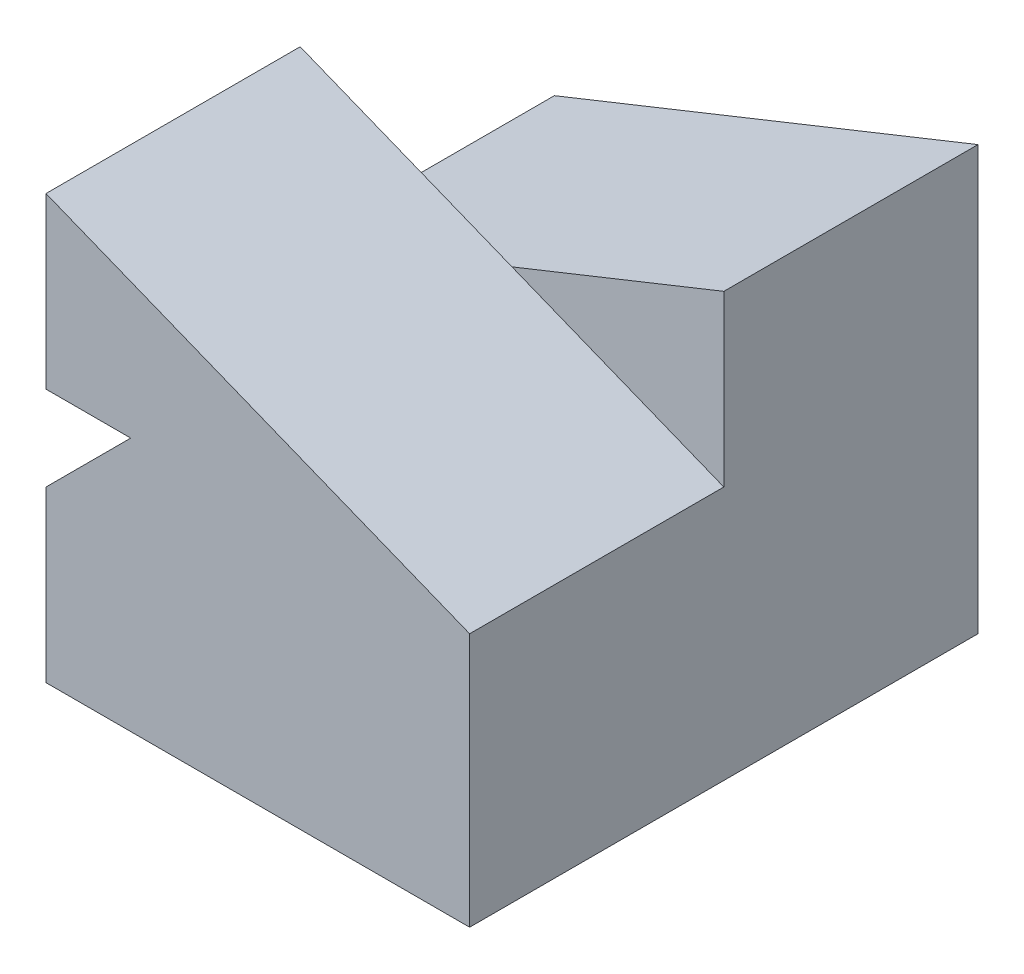
ISO-10303-21;
HEADER;
FILE_DESCRIPTION(('STEP AP214'),'2;1');
FILE_NAME('part.step','',(''),(''),'','','');
FILE_SCHEMA(('AUTOMOTIVE_DESIGN { 1 0 10303 214 1 1 1 1 }'));
ENDSEC;
DATA;
#1=APPLICATION_CONTEXT('core data for automotive mechanical design processes');
#2=APPLICATION_PROTOCOL_DEFINITION('international standard','automotive_design',2000,#1);
#3=PRODUCT_CONTEXT('',#1,'mechanical');
#4=PRODUCT('Part','Part','',(#3));
#5=PRODUCT_RELATED_PRODUCT_CATEGORY('part','',(#4));
#6=PRODUCT_DEFINITION_FORMATION('','',#4);
#7=PRODUCT_DEFINITION_CONTEXT('part definition',#1,'design');
#8=PRODUCT_DEFINITION('design','',#6,#7);
#9=PRODUCT_DEFINITION_SHAPE('','',#8);
#10=(LENGTH_UNIT() NAMED_UNIT(*) SI_UNIT(.MILLI.,.METRE.));
#11=(NAMED_UNIT(*) PLANE_ANGLE_UNIT() SI_UNIT($,.RADIAN.));
#12=(NAMED_UNIT(*) SI_UNIT($,.STERADIAN.) SOLID_ANGLE_UNIT());
#13=UNCERTAINTY_MEASURE_WITH_UNIT(LENGTH_MEASURE(1.E-05),#10,'distance_accuracy_value','');
#14=(GEOMETRIC_REPRESENTATION_CONTEXT(3) GLOBAL_UNCERTAINTY_ASSIGNED_CONTEXT((#13)) GLOBAL_UNIT_ASSIGNED_CONTEXT((#10,
#11,#12)) REPRESENTATION_CONTEXT('',''));
#15=CARTESIAN_POINT('',(0.,0.,0.));
#16=DIRECTION('',(0.,0.,1.));
#17=DIRECTION('',(1.,0.,0.));
#18=AXIS2_PLACEMENT_3D('',#15,#16,#17);
#19=CARTESIAN_POINT('',(0.,0.,0.));
#20=DIRECTION('',(0.,0.,1.));
#21=DIRECTION('',(1.,0.,0.));
#22=AXIS2_PLACEMENT_3D('',#19,#20,#21);
#23=PLANE('',#22);
#24=DIRECTION('',(0.928476690885259,0.371390676354104,0.));
#25=VECTOR('',#24,1.);
#26=CARTESIAN_POINT('',(0.,25.,0.));
#27=LINE('',#26,#25);
#28=CARTESIAN_POINT('',(-25.,15.,0.));
#29=VERTEX_POINT('',#28);
#30=CARTESIAN_POINT('',(-12.5,20.,0.));
#31=VERTEX_POINT('',#30);
#32=EDGE_CURVE('E143',#29,#31,#27,.T.);
#33=ORIENTED_EDGE('',*,*,#32,.F.);
#34=DIRECTION('',(0.,1.,0.));
#35=VECTOR('',#34,1.);
#36=CARTESIAN_POINT('',(-25.,25.,0.));
#37=LINE('',#36,#35);
#38=CARTESIAN_POINT('',(-25.,25.,0.));
#39=VERTEX_POINT('',#38);
#40=EDGE_CURVE('E156',#29,#39,#37,.T.);
#41=ORIENTED_EDGE('',*,*,#40,.T.);
#42=DIRECTION('',(0.928476690885259,-0.371390676354104,0.));
#43=VECTOR('',#42,1.);
#44=CARTESIAN_POINT('',(0.,15.,0.));
#45=LINE('',#44,#43);
#46=EDGE_CURVE('E192',#39,#31,#45,.T.);
#47=ORIENTED_EDGE('',*,*,#46,.T.);
#48=EDGE_LOOP('',(#33,#41,#47));
#49=FACE_BOUND('',#48,.T.);
#50=ADVANCED_FACE('F33',(#49),#23,.F.);
#51=CARTESIAN_POINT('',(-25.,10.,15.));
#52=DIRECTION('',(1.,0.,0.));
#53=DIRECTION('',(0.,0.,-1.));
#54=AXIS2_PLACEMENT_3D('',#51,#52,#53);
#55=PLANE('',#54);
#56=DIRECTION('',(0.,0.,-1.));
#57=VECTOR('',#56,1.);
#58=CARTESIAN_POINT('',(-25.,10.,15.));
#59=LINE('',#58,#57);
#60=CARTESIAN_POINT('',(-25.,10.,15.));
#61=VERTEX_POINT('',#60);
#62=CARTESIAN_POINT('',(-25.,10.,0.));
#63=VERTEX_POINT('',#62);
#64=EDGE_CURVE('E171',#61,#63,#59,.T.);
#65=ORIENTED_EDGE('',*,*,#64,.T.);
#66=DIRECTION('',(0.,1.,0.));
#67=VECTOR('',#66,1.);
#68=CARTESIAN_POINT('',(-25.,15.,0.));
#69=LINE('',#68,#67);
#70=EDGE_CURVE('E135',#63,#29,#69,.T.);
#71=ORIENTED_EDGE('',*,*,#70,.T.);
#72=DIRECTION('',(0.,0.,1.));
#73=VECTOR('',#72,1.);
#74=CARTESIAN_POINT('',(-25.,15.,-15.));
#75=LINE('',#74,#73);
#76=CARTESIAN_POINT('',(-25.,15.,-15.));
#77=VERTEX_POINT('',#76);
#78=EDGE_CURVE('E149',#77,#29,#75,.T.);
#79=ORIENTED_EDGE('',*,*,#78,.F.);
#80=DIRECTION('',(0.,1.,0.));
#81=VECTOR('',#80,1.);
#82=CARTESIAN_POINT('',(-25.,15.,-15.));
#83=LINE('',#82,#81);
#84=CARTESIAN_POINT('',(-25.,0.,-15.));
#85=VERTEX_POINT('',#84);
#86=EDGE_CURVE('E129',#85,#77,#83,.T.);
#87=ORIENTED_EDGE('',*,*,#86,.F.);
#88=DIRECTION('',(0.,0.,-1.));
#89=VECTOR('',#88,1.);
#90=CARTESIAN_POINT('',(-25.,0.,15.));
#91=LINE('',#90,#89);
#92=CARTESIAN_POINT('',(-25.,0.,15.));
#93=VERTEX_POINT('',#92);
#94=EDGE_CURVE('E11',#93,#85,#91,.T.);
#95=ORIENTED_EDGE('',*,*,#94,.F.);
#96=DIRECTION('',(0.,-1.,0.));
#97=VECTOR('',#96,1.);
#98=CARTESIAN_POINT('',(-25.,10.,15.));
#99=LINE('',#98,#97);
#100=EDGE_CURVE('E166',#61,#93,#99,.T.);
#101=ORIENTED_EDGE('',*,*,#100,.F.);
#102=EDGE_LOOP('',(#65,#71,#79,#87,#95,#101));
#103=FACE_BOUND('',#102,.T.);
#104=ADVANCED_FACE('F35',(#103),#55,.F.);
#105=CARTESIAN_POINT('',(-25.,0.,15.));
#106=DIRECTION('',(0.,1.,0.));
#107=DIRECTION('',(0.,0.,1.));
#108=AXIS2_PLACEMENT_3D('',#105,#106,#107);
#109=PLANE('',#108);
#110=ORIENTED_EDGE('',*,*,#94,.T.);
#111=DIRECTION('',(-1.,0.,0.));
#112=VECTOR('',#111,1.);
#113=CARTESIAN_POINT('',(-25.,0.,-15.));
#114=LINE('',#113,#112);
#115=CARTESIAN_POINT('',(0.,0.,-15.));
#116=VERTEX_POINT('',#115);
#117=EDGE_CURVE('E120',#116,#85,#114,.T.);
#118=ORIENTED_EDGE('',*,*,#117,.F.);
#119=DIRECTION('',(0.,0.,-1.));
#120=VECTOR('',#119,1.);
#121=CARTESIAN_POINT('',(0.,0.,15.));
#122=LINE('',#121,#120);
#123=CARTESIAN_POINT('',(0.,0.,15.));
#124=VERTEX_POINT('',#123);
#125=EDGE_CURVE('E42',#124,#116,#122,.T.);
#126=ORIENTED_EDGE('',*,*,#125,.F.);
#127=DIRECTION('',(1.,0.,0.));
#128=VECTOR('',#127,1.);
#129=CARTESIAN_POINT('',(-25.,0.,15.));
#130=LINE('',#129,#128);
#131=EDGE_CURVE('E56',#93,#124,#130,.T.);
#132=ORIENTED_EDGE('',*,*,#131,.F.);
#133=EDGE_LOOP('',(#110,#118,#126,#132));
#134=FACE_BOUND('',#133,.T.);
#135=ADVANCED_FACE('F127',(#134),#109,.F.);
#136=CARTESIAN_POINT('',(0.,0.,15.));
#137=DIRECTION('',(-1.,0.,0.));
#138=DIRECTION('',(0.,0.,1.));
#139=AXIS2_PLACEMENT_3D('',#136,#137,#138);
#140=PLANE('',#139);
#141=ORIENTED_EDGE('',*,*,#125,.T.);
#142=DIRECTION('',(0.,-1.,0.));
#143=VECTOR('',#142,1.);
#144=CARTESIAN_POINT('',(0.,15.,-15.));
#145=LINE('',#144,#143);
#146=CARTESIAN_POINT('',(0.,25.,-15.));
#147=VERTEX_POINT('',#146);
#148=EDGE_CURVE('E109',#147,#116,#145,.T.);
#149=ORIENTED_EDGE('',*,*,#148,.F.);
#150=DIRECTION('',(0.,0.,1.));
#151=VECTOR('',#150,1.);
#152=CARTESIAN_POINT('',(0.,25.,-15.));
#153=LINE('',#152,#151);
#154=CARTESIAN_POINT('',(0.,25.,0.));
#155=VERTEX_POINT('',#154);
#156=EDGE_CURVE('E125',#147,#155,#153,.T.);
#157=ORIENTED_EDGE('',*,*,#156,.T.);
#158=DIRECTION('',(0.,-1.,0.));
#159=VECTOR('',#158,1.);
#160=CARTESIAN_POINT('',(0.,15.,0.));
#161=LINE('',#160,#159);
#162=CARTESIAN_POINT('',(0.,15.,0.));
#163=VERTEX_POINT('',#162);
#164=EDGE_CURVE('E141',#155,#163,#161,.T.);
#165=ORIENTED_EDGE('',*,*,#164,.T.);
#166=DIRECTION('',(0.,0.,-1.));
#167=VECTOR('',#166,1.);
#168=CARTESIAN_POINT('',(0.,15.,15.));
#169=LINE('',#168,#167);
#170=CARTESIAN_POINT('',(0.,15.,15.));
#171=VERTEX_POINT('',#170);
#172=EDGE_CURVE('E114',#171,#163,#169,.T.);
#173=ORIENTED_EDGE('',*,*,#172,.F.);
#174=DIRECTION('',(0.,1.,0.));
#175=VECTOR('',#174,1.);
#176=CARTESIAN_POINT('',(0.,0.,15.));
#177=LINE('',#176,#175);
#178=EDGE_CURVE('E111',#124,#171,#177,.T.);
#179=ORIENTED_EDGE('',*,*,#178,.F.);
#180=EDGE_LOOP('',(#141,#149,#157,#165,#173,#179));
#181=FACE_BOUND('',#180,.T.);
#182=ADVANCED_FACE('F107',(#181),#140,.F.);
#183=CARTESIAN_POINT('',(-20.,15.,15.));
#184=DIRECTION('',(0.707106781186547,-0.707106781186548,0.));
#185=DIRECTION('',(0.707106781186548,0.707106781186547,0.));
#186=AXIS2_PLACEMENT_3D('',#183,#184,#185);
#187=PLANE('',#186);
#188=DIRECTION('',(-0.707106781186548,-0.707106781186547,0.));
#189=VECTOR('',#188,1.);
#190=CARTESIAN_POINT('',(-20.,15.,0.));
#191=LINE('',#190,#189);
#192=CARTESIAN_POINT('',(-20.,15.,0.));
#193=VERTEX_POINT('',#192);
#194=EDGE_CURVE('E168',#193,#63,#191,.T.);
#195=ORIENTED_EDGE('',*,*,#194,.T.);
#196=ORIENTED_EDGE('',*,*,#64,.F.);
#197=DIRECTION('',(-0.707106781186548,-0.707106781186547,0.));
#198=VECTOR('',#197,1.);
#199=CARTESIAN_POINT('',(-20.,15.,15.));
#200=LINE('',#199,#198);
#201=CARTESIAN_POINT('',(-20.,15.,15.));
#202=VERTEX_POINT('',#201);
#203=EDGE_CURVE('E50',#202,#61,#200,.T.);
#204=ORIENTED_EDGE('',*,*,#203,.F.);
#205=DIRECTION('',(0.,0.,-1.));
#206=VECTOR('',#205,1.);
#207=CARTESIAN_POINT('',(-20.,15.,15.));
#208=LINE('',#207,#206);
#209=EDGE_CURVE('E174',#202,#193,#208,.T.);
#210=ORIENTED_EDGE('',*,*,#209,.T.);
#211=EDGE_LOOP('',(#195,#196,#204,#210));
#212=FACE_BOUND('',#211,.T.);
#213=ADVANCED_FACE('F229',(#212),#187,.F.);
#214=CARTESIAN_POINT('',(0.,0.,15.));
#215=DIRECTION('',(0.,0.,1.));
#216=DIRECTION('',(1.,0.,0.));
#217=AXIS2_PLACEMENT_3D('',#214,#215,#216);
#218=PLANE('',#217);
#219=ORIENTED_EDGE('',*,*,#100,.T.);
#220=ORIENTED_EDGE('',*,*,#131,.T.);
#221=ORIENTED_EDGE('',*,*,#178,.T.);
#222=DIRECTION('',(0.928476690885259,-0.371390676354104,0.));
#223=VECTOR('',#222,1.);
#224=CARTESIAN_POINT('',(0.,15.,15.));
#225=LINE('',#224,#223);
#226=CARTESIAN_POINT('',(-25.,25.,15.));
#227=VERTEX_POINT('',#226);
#228=EDGE_CURVE('E153',#227,#171,#225,.T.);
#229=ORIENTED_EDGE('',*,*,#228,.F.);
#230=DIRECTION('',(0.,1.,0.));
#231=VECTOR('',#230,1.);
#232=CARTESIAN_POINT('',(-25.,25.,15.));
#233=LINE('',#232,#231);
#234=CARTESIAN_POINT('',(-25.,15.,15.));
#235=VERTEX_POINT('',#234);
#236=EDGE_CURVE('E159',#235,#227,#233,.T.);
#237=ORIENTED_EDGE('',*,*,#236,.F.);
#238=DIRECTION('',(-1.,0.,0.));
#239=VECTOR('',#238,1.);
#240=CARTESIAN_POINT('',(-25.,15.,15.));
#241=LINE('',#240,#239);
#242=EDGE_CURVE('E155',#202,#235,#241,.T.);
#243=ORIENTED_EDGE('',*,*,#242,.F.);
#244=ORIENTED_EDGE('',*,*,#203,.T.);
#245=EDGE_LOOP('',(#219,#220,#221,#229,#237,#243,#244));
#246=FACE_BOUND('',#245,.T.);
#247=ADVANCED_FACE('F228',(#246),#218,.T.);
#248=CARTESIAN_POINT('',(-25.,15.,15.));
#249=DIRECTION('',(0.,-1.,0.));
#250=DIRECTION('',(1.,0.,0.));
#251=AXIS2_PLACEMENT_3D('',#248,#249,#250);
#252=PLANE('',#251);
#253=DIRECTION('',(1.,0.,0.));
#254=VECTOR('',#253,1.);
#255=CARTESIAN_POINT('',(0.,15.,0.));
#256=LINE('',#255,#254);
#257=EDGE_CURVE('E130',#29,#193,#256,.T.);
#258=ORIENTED_EDGE('',*,*,#257,.T.);
#259=ORIENTED_EDGE('',*,*,#209,.F.);
#260=ORIENTED_EDGE('',*,*,#242,.T.);
#261=DIRECTION('',(0.,0.,-1.));
#262=VECTOR('',#261,1.);
#263=CARTESIAN_POINT('',(-25.,15.,15.));
#264=LINE('',#263,#262);
#265=EDGE_CURVE('E164',#235,#29,#264,.T.);
#266=ORIENTED_EDGE('',*,*,#265,.T.);
#267=EDGE_LOOP('',(#258,#259,#260,#266));
#268=FACE_BOUND('',#267,.T.);
#269=ADVANCED_FACE('F206',(#268),#252,.T.);
#270=CARTESIAN_POINT('',(0.,15.,15.));
#271=DIRECTION('',(0.371390676354104,0.928476690885259,0.));
#272=DIRECTION('',(-0.928476690885259,0.371390676354104,0.));
#273=AXIS2_PLACEMENT_3D('',#270,#271,#272);
#274=PLANE('',#273);
#275=ORIENTED_EDGE('',*,*,#46,.F.);
#276=DIRECTION('',(0.,0.,-1.));
#277=VECTOR('',#276,1.);
#278=CARTESIAN_POINT('',(-25.,25.,15.));
#279=LINE('',#278,#277);
#280=EDGE_CURVE('E182',#227,#39,#279,.T.);
#281=ORIENTED_EDGE('',*,*,#280,.F.);
#282=ORIENTED_EDGE('',*,*,#228,.T.);
#283=ORIENTED_EDGE('',*,*,#172,.T.);
#284=EDGE_CURVE('E152',#31,#163,#45,.T.);
#285=ORIENTED_EDGE('',*,*,#284,.F.);
#286=EDGE_LOOP('',(#275,#281,#282,#283,#285));
#287=FACE_BOUND('',#286,.T.);
#288=ADVANCED_FACE('F211',(#287),#274,.T.);
#289=CARTESIAN_POINT('',(-25.,25.,15.));
#290=DIRECTION('',(-1.,0.,0.));
#291=DIRECTION('',(0.,0.,1.));
#292=AXIS2_PLACEMENT_3D('',#289,#290,#291);
#293=PLANE('',#292);
#294=ORIENTED_EDGE('',*,*,#40,.F.);
#295=ORIENTED_EDGE('',*,*,#265,.F.);
#296=ORIENTED_EDGE('',*,*,#236,.T.);
#297=ORIENTED_EDGE('',*,*,#280,.T.);
#298=EDGE_LOOP('',(#294,#295,#296,#297));
#299=FACE_BOUND('',#298,.T.);
#300=ADVANCED_FACE('F209',(#299),#293,.T.);
#301=CARTESIAN_POINT('',(0.,25.,-15.));
#302=DIRECTION('',(0.371390676354104,-0.928476690885259,0.));
#303=DIRECTION('',(0.928476690885259,0.371390676354104,0.));
#304=AXIS2_PLACEMENT_3D('',#301,#302,#303);
#305=PLANE('',#304);
#306=ORIENTED_EDGE('',*,*,#32,.T.);
#307=EDGE_CURVE('E132',#31,#155,#27,.T.);
#308=ORIENTED_EDGE('',*,*,#307,.T.);
#309=ORIENTED_EDGE('',*,*,#156,.F.);
#310=DIRECTION('',(0.928476690885259,0.371390676354104,0.));
#311=VECTOR('',#310,1.);
#312=CARTESIAN_POINT('',(0.,25.,-15.));
#313=LINE('',#312,#311);
#314=EDGE_CURVE('E123',#77,#147,#313,.T.);
#315=ORIENTED_EDGE('',*,*,#314,.F.);
#316=ORIENTED_EDGE('',*,*,#78,.T.);
#317=EDGE_LOOP('',(#306,#308,#309,#315,#316));
#318=FACE_BOUND('',#317,.T.);
#319=ADVANCED_FACE('F203',(#318),#305,.F.);
#320=CARTESIAN_POINT('',(0.,0.,-15.));
#321=DIRECTION('',(0.,0.,1.));
#322=DIRECTION('',(1.,0.,0.));
#323=AXIS2_PLACEMENT_3D('',#320,#321,#322);
#324=PLANE('',#323);
#325=ORIENTED_EDGE('',*,*,#148,.T.);
#326=ORIENTED_EDGE('',*,*,#117,.T.);
#327=ORIENTED_EDGE('',*,*,#86,.T.);
#328=ORIENTED_EDGE('',*,*,#314,.T.);
#329=EDGE_LOOP('',(#325,#326,#327,#328));
#330=FACE_BOUND('',#329,.T.);
#331=ADVANCED_FACE('F118',(#330),#324,.F.);
#332=CARTESIAN_POINT('',(0.,0.,0.));
#333=DIRECTION('',(0.,0.,1.));
#334=DIRECTION('',(1.,0.,0.));
#335=AXIS2_PLACEMENT_3D('',#332,#333,#334);
#336=PLANE('',#335);
#337=ORIENTED_EDGE('',*,*,#307,.F.);
#338=ORIENTED_EDGE('',*,*,#284,.T.);
#339=ORIENTED_EDGE('',*,*,#164,.F.);
#340=EDGE_LOOP('',(#337,#338,#339));
#341=FACE_BOUND('',#340,.T.);
#342=ADVANCED_FACE('F200',(#341),#336,.T.);
#343=CARTESIAN_POINT('',(0.,0.,0.));
#344=DIRECTION('',(0.,0.,1.));
#345=DIRECTION('',(1.,0.,0.));
#346=AXIS2_PLACEMENT_3D('',#343,#344,#345);
#347=PLANE('',#346);
#348=ORIENTED_EDGE('',*,*,#194,.F.);
#349=ORIENTED_EDGE('',*,*,#257,.F.);
#350=ORIENTED_EDGE('',*,*,#70,.F.);
#351=EDGE_LOOP('',(#348,#349,#350));
#352=FACE_BOUND('',#351,.T.);
#353=ADVANCED_FACE('F290',(#352),#347,.T.);
#354=CLOSED_SHELL('',(#50,#104,#135,#182,#213,#247,#269,#288,#300,#319,#331,#342,#353));
#355=MANIFOLD_SOLID_BREP('B2',#354);
#356=ADVANCED_BREP_SHAPE_REPRESENTATION('',(#18,#355),#14);
#357=SHAPE_DEFINITION_REPRESENTATION(#9,#356);
ENDSEC;
END-ISO-10303-21;
